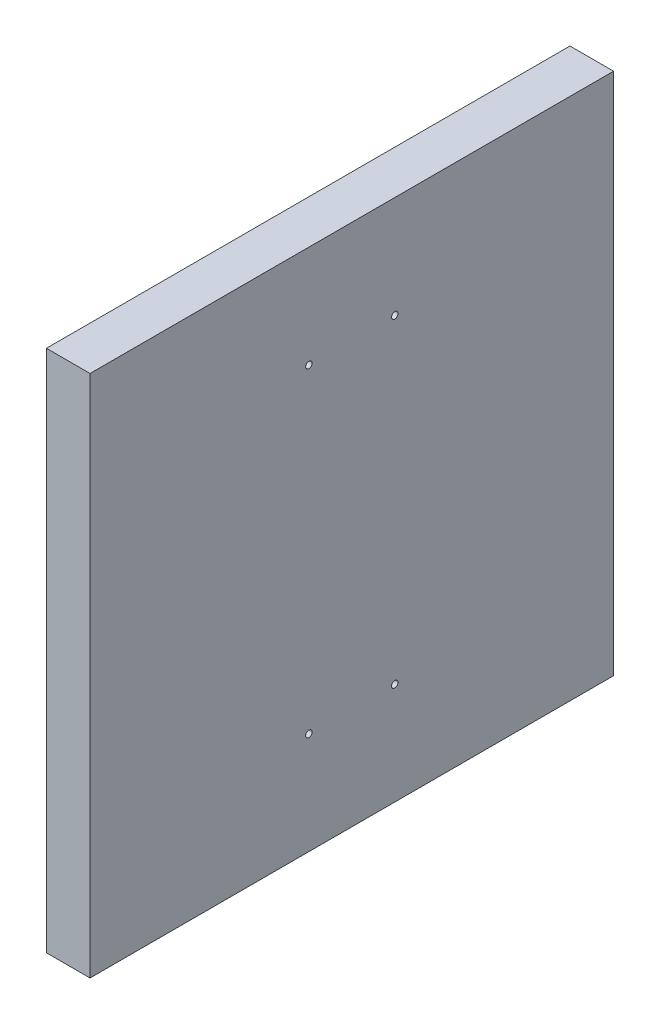
ISO-10303-21;
HEADER;
FILE_DESCRIPTION(('STEP AP214'),'2;1');
FILE_NAME('part.step','',(''),(''),'','','');
FILE_SCHEMA(('AUTOMOTIVE_DESIGN { 1 0 10303 214 1 1 1 1 }'));
ENDSEC;
DATA;
#1=APPLICATION_CONTEXT('core data for automotive mechanical design processes');
#2=APPLICATION_PROTOCOL_DEFINITION('international standard','automotive_design',2000,#1);
#3=PRODUCT_CONTEXT('',#1,'mechanical');
#4=PRODUCT('Part','Part','',(#3));
#5=PRODUCT_RELATED_PRODUCT_CATEGORY('part','',(#4));
#6=PRODUCT_DEFINITION_FORMATION('','',#4);
#7=PRODUCT_DEFINITION_CONTEXT('part definition',#1,'design');
#8=PRODUCT_DEFINITION('design','',#6,#7);
#9=PRODUCT_DEFINITION_SHAPE('','',#8);
#10=(LENGTH_UNIT() NAMED_UNIT(*) SI_UNIT(.MILLI.,.METRE.));
#11=(NAMED_UNIT(*) PLANE_ANGLE_UNIT() SI_UNIT($,.RADIAN.));
#12=(NAMED_UNIT(*) SI_UNIT($,.STERADIAN.) SOLID_ANGLE_UNIT());
#13=UNCERTAINTY_MEASURE_WITH_UNIT(LENGTH_MEASURE(1.E-05),#10,'distance_accuracy_value','');
#14=(GEOMETRIC_REPRESENTATION_CONTEXT(3) GLOBAL_UNCERTAINTY_ASSIGNED_CONTEXT((#13)) GLOBAL_UNIT_ASSIGNED_CONTEXT((#10,
#11,#12)) REPRESENTATION_CONTEXT('',''));
#15=CARTESIAN_POINT('',(0.,0.,0.));
#16=DIRECTION('',(0.,0.,1.));
#17=DIRECTION('',(1.,0.,0.));
#18=AXIS2_PLACEMENT_3D('',#15,#16,#17);
#19=CARTESIAN_POINT('',(25.4,-152.4,152.4));
#20=DIRECTION('',(0.,0.,-1.));
#21=DIRECTION('',(-1.,0.,0.));
#22=AXIS2_PLACEMENT_3D('',#19,#20,#21);
#23=PLANE('',#22);
#24=DIRECTION('',(0.,-1.,0.));
#25=VECTOR('',#24,1.);
#26=CARTESIAN_POINT('',(0.,-152.4,152.4));
#27=LINE('',#26,#25);
#28=CARTESIAN_POINT('',(0.,152.4,152.4));
#29=VERTEX_POINT('',#28);
#30=CARTESIAN_POINT('',(0.,-152.4,152.4));
#31=VERTEX_POINT('',#30);
#32=EDGE_CURVE('E100',#29,#31,#27,.T.);
#33=ORIENTED_EDGE('',*,*,#32,.T.);
#34=DIRECTION('',(-1.,0.,0.));
#35=VECTOR('',#34,1.);
#36=CARTESIAN_POINT('',(25.4,-152.4,152.4));
#37=LINE('',#36,#35);
#38=CARTESIAN_POINT('',(25.4,-152.4,152.4));
#39=VERTEX_POINT('',#38);
#40=EDGE_CURVE('E11',#39,#31,#37,.T.);
#41=ORIENTED_EDGE('',*,*,#40,.F.);
#42=DIRECTION('',(0.,-1.,0.));
#43=VECTOR('',#42,1.);
#44=CARTESIAN_POINT('',(25.4,-152.4,152.4));
#45=LINE('',#44,#43);
#46=CARTESIAN_POINT('',(25.4,152.4,152.4));
#47=VERTEX_POINT('',#46);
#48=EDGE_CURVE('E88',#47,#39,#45,.T.);
#49=ORIENTED_EDGE('',*,*,#48,.F.);
#50=DIRECTION('',(-1.,0.,0.));
#51=VECTOR('',#50,1.);
#52=CARTESIAN_POINT('',(25.4,152.4,152.4));
#53=LINE('',#52,#51);
#54=EDGE_CURVE('E96',#47,#29,#53,.T.);
#55=ORIENTED_EDGE('',*,*,#54,.T.);
#56=EDGE_LOOP('',(#33,#41,#49,#55));
#57=FACE_BOUND('',#56,.T.);
#58=ADVANCED_FACE('F37',(#57),#23,.F.);
#59=CARTESIAN_POINT('',(25.4,-152.4,152.4));
#60=DIRECTION('',(0.,1.,0.));
#61=DIRECTION('',(0.,0.,1.));
#62=AXIS2_PLACEMENT_3D('',#59,#60,#61);
#63=PLANE('',#62);
#64=DIRECTION('',(0.,0.,-1.));
#65=VECTOR('',#64,1.);
#66=CARTESIAN_POINT('',(0.,-152.4,152.4));
#67=LINE('',#66,#65);
#68=CARTESIAN_POINT('',(0.,-152.4,-152.4));
#69=VERTEX_POINT('',#68);
#70=EDGE_CURVE('E92',#31,#69,#67,.T.);
#71=ORIENTED_EDGE('',*,*,#70,.T.);
#72=DIRECTION('',(-1.,0.,0.));
#73=VECTOR('',#72,1.);
#74=CARTESIAN_POINT('',(25.4,-152.4,-152.4));
#75=LINE('',#74,#73);
#76=CARTESIAN_POINT('',(25.4,-152.4,-152.4));
#77=VERTEX_POINT('',#76);
#78=EDGE_CURVE('E45',#77,#69,#75,.T.);
#79=ORIENTED_EDGE('',*,*,#78,.F.);
#80=DIRECTION('',(0.,0.,-1.));
#81=VECTOR('',#80,1.);
#82=CARTESIAN_POINT('',(25.4,-152.4,152.4));
#83=LINE('',#82,#81);
#84=EDGE_CURVE('E83',#39,#77,#83,.T.);
#85=ORIENTED_EDGE('',*,*,#84,.F.);
#86=ORIENTED_EDGE('',*,*,#40,.T.);
#87=EDGE_LOOP('',(#71,#79,#85,#86));
#88=FACE_BOUND('',#87,.T.);
#89=ADVANCED_FACE('F91',(#88),#63,.F.);
#90=CARTESIAN_POINT('',(25.4,-152.4,-152.4));
#91=DIRECTION('',(0.,0.,1.));
#92=DIRECTION('',(1.,0.,0.));
#93=AXIS2_PLACEMENT_3D('',#90,#91,#92);
#94=PLANE('',#93);
#95=DIRECTION('',(0.,1.,0.));
#96=VECTOR('',#95,1.);
#97=CARTESIAN_POINT('',(0.,-152.4,-152.4));
#98=LINE('',#97,#96);
#99=CARTESIAN_POINT('',(0.,152.4,-152.4));
#100=VERTEX_POINT('',#99);
#101=EDGE_CURVE('E70',#69,#100,#98,.T.);
#102=ORIENTED_EDGE('',*,*,#101,.T.);
#103=DIRECTION('',(-1.,0.,0.));
#104=VECTOR('',#103,1.);
#105=CARTESIAN_POINT('',(25.4,152.4,-152.4));
#106=LINE('',#105,#104);
#107=CARTESIAN_POINT('',(25.4,152.4,-152.4));
#108=VERTEX_POINT('',#107);
#109=EDGE_CURVE('E93',#108,#100,#106,.T.);
#110=ORIENTED_EDGE('',*,*,#109,.F.);
#111=DIRECTION('',(0.,1.,0.));
#112=VECTOR('',#111,1.);
#113=CARTESIAN_POINT('',(25.4,-152.4,-152.4));
#114=LINE('',#113,#112);
#115=EDGE_CURVE('E86',#77,#108,#114,.T.);
#116=ORIENTED_EDGE('',*,*,#115,.F.);
#117=ORIENTED_EDGE('',*,*,#78,.T.);
#118=EDGE_LOOP('',(#102,#110,#116,#117));
#119=FACE_BOUND('',#118,.T.);
#120=ADVANCED_FACE('F94',(#119),#94,.F.);
#121=CARTESIAN_POINT('',(25.4,152.4,152.4));
#122=DIRECTION('',(0.,-1.,0.));
#123=DIRECTION('',(0.,0.,-1.));
#124=AXIS2_PLACEMENT_3D('',#121,#122,#123);
#125=PLANE('',#124);
#126=DIRECTION('',(0.,0.,1.));
#127=VECTOR('',#126,1.);
#128=CARTESIAN_POINT('',(0.,152.4,152.4));
#129=LINE('',#128,#127);
#130=EDGE_CURVE('E76',#100,#29,#129,.T.);
#131=ORIENTED_EDGE('',*,*,#130,.T.);
#132=ORIENTED_EDGE('',*,*,#54,.F.);
#133=DIRECTION('',(0.,0.,1.));
#134=VECTOR('',#133,1.);
#135=CARTESIAN_POINT('',(25.4,152.4,152.4));
#136=LINE('',#135,#134);
#137=EDGE_CURVE('E53',#108,#47,#136,.T.);
#138=ORIENTED_EDGE('',*,*,#137,.F.);
#139=ORIENTED_EDGE('',*,*,#109,.T.);
#140=EDGE_LOOP('',(#131,#132,#138,#139));
#141=FACE_BOUND('',#140,.T.);
#142=ADVANCED_FACE('F108',(#141),#125,.F.);
#143=CARTESIAN_POINT('',(25.4,0.,0.));
#144=DIRECTION('',(-1.,0.,0.));
#145=DIRECTION('',(0.,0.,1.));
#146=AXIS2_PLACEMENT_3D('',#143,#144,#145);
#147=PLANE('',#146);
#148=CARTESIAN_POINT('',(25.4,-93.,-25.));
#149=DIRECTION('',(1.,0.,0.));
#150=DIRECTION('',(0.,0.,1.));
#151=AXIS2_PLACEMENT_3D('',#148,#149,#150);
#152=CIRCLE('',#151,1.875);
#153=CARTESIAN_POINT('',(25.4,-93.,-23.125));
#154=VERTEX_POINT('',#153);
#155=EDGE_CURVE('E127',#154,#154,#152,.T.);
#156=ORIENTED_EDGE('',*,*,#155,.F.);
#157=EDGE_LOOP('',(#156));
#158=FACE_BOUND('',#157,.T.);
#159=CARTESIAN_POINT('',(25.4,93.,25.));
#160=DIRECTION('',(1.,0.,0.));
#161=DIRECTION('',(0.,0.,1.));
#162=AXIS2_PLACEMENT_3D('',#159,#160,#161);
#163=CIRCLE('',#162,1.875);
#164=CARTESIAN_POINT('',(25.4,93.,26.875));
#165=VERTEX_POINT('',#164);
#166=EDGE_CURVE('E120',#165,#165,#163,.T.);
#167=ORIENTED_EDGE('',*,*,#166,.F.);
#168=EDGE_LOOP('',(#167));
#169=FACE_BOUND('',#168,.T.);
#170=CARTESIAN_POINT('',(25.4,93.,-25.));
#171=DIRECTION('',(1.,0.,0.));
#172=DIRECTION('',(0.,0.,-1.));
#173=AXIS2_PLACEMENT_3D('',#170,#171,#172);
#174=CIRCLE('',#173,1.875);
#175=CARTESIAN_POINT('',(25.4,93.,-26.875));
#176=VERTEX_POINT('',#175);
#177=EDGE_CURVE('E132',#176,#176,#174,.T.);
#178=ORIENTED_EDGE('',*,*,#177,.F.);
#179=EDGE_LOOP('',(#178));
#180=FACE_BOUND('',#179,.T.);
#181=CARTESIAN_POINT('',(25.4,-93.,25.));
#182=DIRECTION('',(1.,0.,0.));
#183=DIRECTION('',(0.,0.,-1.));
#184=AXIS2_PLACEMENT_3D('',#181,#182,#183);
#185=CIRCLE('',#184,1.875);
#186=CARTESIAN_POINT('',(25.4,-93.,23.125));
#187=VERTEX_POINT('',#186);
#188=EDGE_CURVE('E114',#187,#187,#185,.T.);
#189=ORIENTED_EDGE('',*,*,#188,.F.);
#190=EDGE_LOOP('',(#189));
#191=FACE_BOUND('',#190,.T.);
#192=ORIENTED_EDGE('',*,*,#48,.T.);
#193=ORIENTED_EDGE('',*,*,#84,.T.);
#194=ORIENTED_EDGE('',*,*,#115,.T.);
#195=ORIENTED_EDGE('',*,*,#137,.T.);
#196=EDGE_LOOP('',(#192,#193,#194,#195));
#197=FACE_BOUND('',#196,.T.);
#198=ADVANCED_FACE('F84',(#158,#169,#180,#191,#197),#147,.F.);
#199=CARTESIAN_POINT('',(0.,0.,0.));
#200=DIRECTION('',(-1.,0.,0.));
#201=DIRECTION('',(0.,0.,1.));
#202=AXIS2_PLACEMENT_3D('',#199,#200,#201);
#203=PLANE('',#202);
#204=CARTESIAN_POINT('',(0.,-93.,-25.));
#205=DIRECTION('',(1.,0.,0.));
#206=DIRECTION('',(0.,0.,1.));
#207=AXIS2_PLACEMENT_3D('',#204,#205,#206);
#208=CIRCLE('',#207,1.875);
#209=CARTESIAN_POINT('',(0.,-93.,-23.125));
#210=VERTEX_POINT('',#209);
#211=EDGE_CURVE('E117',#210,#210,#208,.T.);
#212=ORIENTED_EDGE('',*,*,#211,.T.);
#213=EDGE_LOOP('',(#212));
#214=FACE_BOUND('',#213,.T.);
#215=CARTESIAN_POINT('',(0.,93.,25.));
#216=DIRECTION('',(1.,0.,0.));
#217=DIRECTION('',(0.,0.,1.));
#218=AXIS2_PLACEMENT_3D('',#215,#216,#217);
#219=CIRCLE('',#218,1.875);
#220=CARTESIAN_POINT('',(0.,93.,26.875));
#221=VERTEX_POINT('',#220);
#222=EDGE_CURVE('E123',#221,#221,#219,.T.);
#223=ORIENTED_EDGE('',*,*,#222,.T.);
#224=EDGE_LOOP('',(#223));
#225=FACE_BOUND('',#224,.T.);
#226=CARTESIAN_POINT('',(0.,93.,-25.));
#227=DIRECTION('',(1.,0.,0.));
#228=DIRECTION('',(0.,0.,-1.));
#229=AXIS2_PLACEMENT_3D('',#226,#227,#228);
#230=CIRCLE('',#229,1.875);
#231=CARTESIAN_POINT('',(0.,93.,-26.875));
#232=VERTEX_POINT('',#231);
#233=EDGE_CURVE('E124',#232,#232,#230,.T.);
#234=ORIENTED_EDGE('',*,*,#233,.T.);
#235=EDGE_LOOP('',(#234));
#236=FACE_BOUND('',#235,.T.);
#237=CARTESIAN_POINT('',(0.,-93.,25.));
#238=DIRECTION('',(1.,0.,0.));
#239=DIRECTION('',(0.,0.,-1.));
#240=AXIS2_PLACEMENT_3D('',#237,#238,#239);
#241=CIRCLE('',#240,1.875);
#242=CARTESIAN_POINT('',(0.,-93.,23.125));
#243=VERTEX_POINT('',#242);
#244=EDGE_CURVE('E103',#243,#243,#241,.T.);
#245=ORIENTED_EDGE('',*,*,#244,.T.);
#246=EDGE_LOOP('',(#245));
#247=FACE_BOUND('',#246,.T.);
#248=ORIENTED_EDGE('',*,*,#32,.F.);
#249=ORIENTED_EDGE('',*,*,#130,.F.);
#250=ORIENTED_EDGE('',*,*,#101,.F.);
#251=ORIENTED_EDGE('',*,*,#70,.F.);
#252=EDGE_LOOP('',(#248,#249,#250,#251));
#253=FACE_BOUND('',#252,.T.);
#254=ADVANCED_FACE('F111',(#214,#225,#236,#247,#253),#203,.T.);
#255=CARTESIAN_POINT('',(0.,-93.,25.));
#256=DIRECTION('',(1.,0.,0.));
#257=DIRECTION('',(0.,0.,-1.));
#258=AXIS2_PLACEMENT_3D('',#255,#256,#257);
#259=CYLINDRICAL_SURFACE('',#258,1.875);
#260=ORIENTED_EDGE('',*,*,#244,.F.);
#261=EDGE_LOOP('',(#260));
#262=FACE_BOUND('',#261,.T.);
#263=ORIENTED_EDGE('',*,*,#188,.T.);
#264=EDGE_LOOP('',(#263));
#265=FACE_BOUND('',#264,.T.);
#266=ADVANCED_FACE('F144',(#262,#265),#259,.F.);
#267=CARTESIAN_POINT('',(0.,93.,-25.));
#268=DIRECTION('',(1.,0.,0.));
#269=DIRECTION('',(0.,0.,-1.));
#270=AXIS2_PLACEMENT_3D('',#267,#268,#269);
#271=CYLINDRICAL_SURFACE('',#270,1.875);
#272=ORIENTED_EDGE('',*,*,#233,.F.);
#273=EDGE_LOOP('',(#272));
#274=FACE_BOUND('',#273,.T.);
#275=ORIENTED_EDGE('',*,*,#177,.T.);
#276=EDGE_LOOP('',(#275));
#277=FACE_BOUND('',#276,.T.);
#278=ADVANCED_FACE('F140',(#274,#277),#271,.F.);
#279=CARTESIAN_POINT('',(0.,93.,25.));
#280=DIRECTION('',(1.,0.,0.));
#281=DIRECTION('',(0.,0.,-1.));
#282=AXIS2_PLACEMENT_3D('',#279,#280,#281);
#283=CYLINDRICAL_SURFACE('',#282,1.875);
#284=ORIENTED_EDGE('',*,*,#222,.F.);
#285=EDGE_LOOP('',(#284));
#286=FACE_BOUND('',#285,.T.);
#287=ORIENTED_EDGE('',*,*,#166,.T.);
#288=EDGE_LOOP('',(#287));
#289=FACE_BOUND('',#288,.T.);
#290=ADVANCED_FACE('F143',(#286,#289),#283,.F.);
#291=CARTESIAN_POINT('',(0.,-93.,-25.));
#292=DIRECTION('',(1.,0.,0.));
#293=DIRECTION('',(0.,0.,-1.));
#294=AXIS2_PLACEMENT_3D('',#291,#292,#293);
#295=CYLINDRICAL_SURFACE('',#294,1.875);
#296=ORIENTED_EDGE('',*,*,#211,.F.);
#297=EDGE_LOOP('',(#296));
#298=FACE_BOUND('',#297,.T.);
#299=ORIENTED_EDGE('',*,*,#155,.T.);
#300=EDGE_LOOP('',(#299));
#301=FACE_BOUND('',#300,.T.);
#302=ADVANCED_FACE('F205',(#298,#301),#295,.F.);
#303=CLOSED_SHELL('',(#58,#89,#120,#142,#198,#254,#266,#278,#290,#302));
#304=MANIFOLD_SOLID_BREP('B2',#303);
#305=ADVANCED_BREP_SHAPE_REPRESENTATION('',(#18,#304),#14);
#306=SHAPE_DEFINITION_REPRESENTATION(#9,#305);
ENDSEC;
END-ISO-10303-21;
